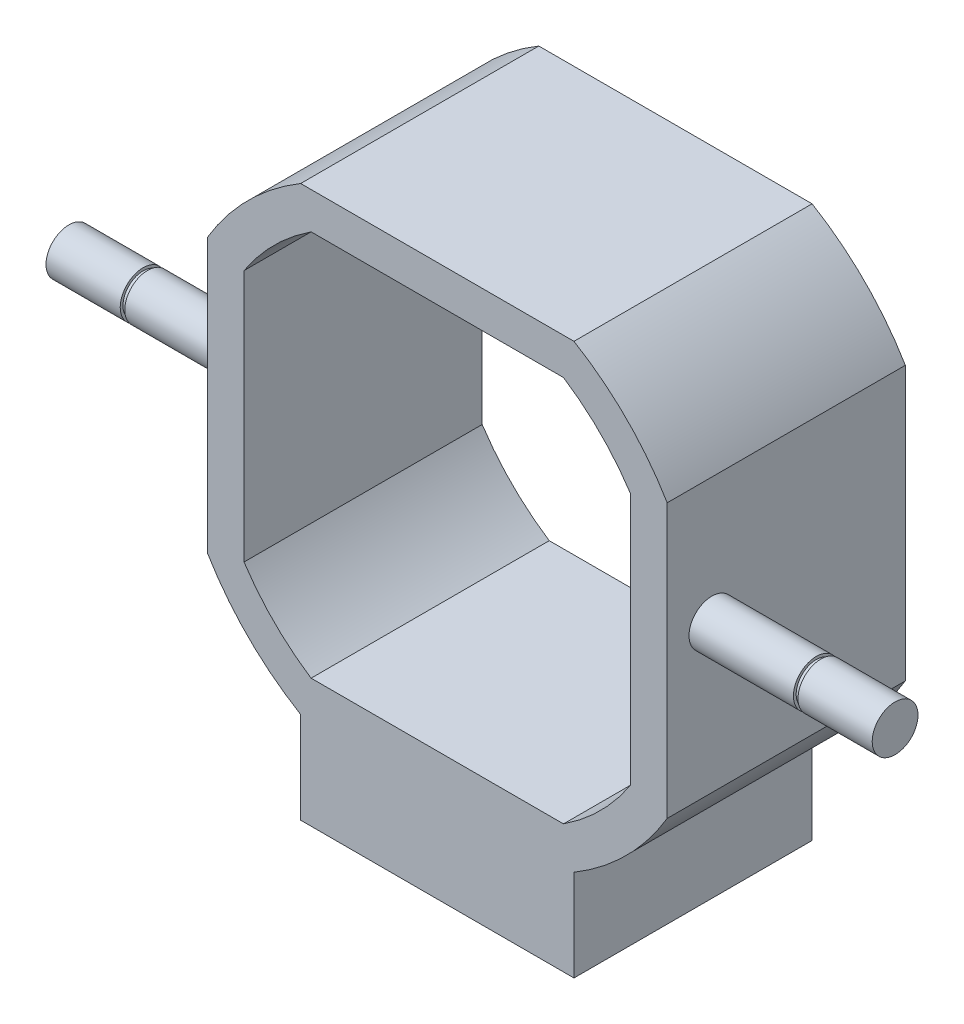
ISO-10303-21;
HEADER;
FILE_DESCRIPTION(('STEP AP214'),'2;1');
FILE_NAME('part.step','',(''),(''),'','','');
FILE_SCHEMA(('AUTOMOTIVE_DESIGN { 1 0 10303 214 1 1 1 1 }'));
ENDSEC;
DATA;
#1=APPLICATION_CONTEXT('core data for automotive mechanical design processes');
#2=APPLICATION_PROTOCOL_DEFINITION('international standard','automotive_design',2000,#1);
#3=PRODUCT_CONTEXT('',#1,'mechanical');
#4=PRODUCT('Part','Part','',(#3));
#5=PRODUCT_RELATED_PRODUCT_CATEGORY('part','',(#4));
#6=PRODUCT_DEFINITION_FORMATION('','',#4);
#7=PRODUCT_DEFINITION_CONTEXT('part definition',#1,'design');
#8=PRODUCT_DEFINITION('design','',#6,#7);
#9=PRODUCT_DEFINITION_SHAPE('','',#8);
#10=(LENGTH_UNIT() NAMED_UNIT(*) SI_UNIT(.MILLI.,.METRE.));
#11=(NAMED_UNIT(*) PLANE_ANGLE_UNIT() SI_UNIT($,.RADIAN.));
#12=(NAMED_UNIT(*) SI_UNIT($,.STERADIAN.) SOLID_ANGLE_UNIT());
#13=UNCERTAINTY_MEASURE_WITH_UNIT(LENGTH_MEASURE(1.E-05),#10,'distance_accuracy_value','');
#14=(GEOMETRIC_REPRESENTATION_CONTEXT(3) GLOBAL_UNCERTAINTY_ASSIGNED_CONTEXT((#13)) GLOBAL_UNIT_ASSIGNED_CONTEXT((#10,
#11,#12)) REPRESENTATION_CONTEXT('',''));
#15=CARTESIAN_POINT('',(0.,0.,0.));
#16=DIRECTION('',(0.,0.,1.));
#17=DIRECTION('',(1.,0.,0.));
#18=AXIS2_PLACEMENT_3D('',#15,#16,#17);
#19=CARTESIAN_POINT('',(-45.1,1.15999999999999,21.12));
#20=DIRECTION('',(1.,0.,0.));
#21=DIRECTION('',(0.,0.,-1.));
#22=AXIS2_PLACEMENT_3D('',#19,#20,#21);
#23=CYLINDRICAL_SURFACE('',#22,2.5);
#24=CARTESIAN_POINT('',(-25.1,1.15999999999999,21.12));
#25=DIRECTION('',(1.,0.,0.));
#26=DIRECTION('',(0.,0.,-1.));
#27=AXIS2_PLACEMENT_3D('',#24,#25,#26);
#28=CIRCLE('',#27,2.5);
#29=CARTESIAN_POINT('',(-25.1,1.15999999999999,18.62));
#30=VERTEX_POINT('',#29);
#31=EDGE_CURVE('E12',#30,#30,#28,.F.);
#32=ORIENTED_EDGE('',*,*,#31,.T.);
#33=EDGE_LOOP('',(#32));
#34=FACE_BOUND('',#33,.T.);
#35=CARTESIAN_POINT('',(-36.5,1.15999999999999,21.12));
#36=DIRECTION('',(-1.,0.,0.));
#37=DIRECTION('',(0.,0.,1.));
#38=AXIS2_PLACEMENT_3D('',#35,#36,#37);
#39=CIRCLE('',#38,2.5);
#40=CARTESIAN_POINT('',(-36.5,1.15999999999999,23.62));
#41=VERTEX_POINT('',#40);
#42=EDGE_CURVE('E384',#41,#41,#39,.T.);
#43=ORIENTED_EDGE('',*,*,#42,.F.);
#44=EDGE_LOOP('',(#43));
#45=FACE_BOUND('',#44,.T.);
#46=ADVANCED_FACE('F83',(#34,#45),#23,.T.);
#47=CARTESIAN_POINT('',(45.1,1.15999999999999,21.12));
#48=DIRECTION('',(-1.,0.,0.));
#49=DIRECTION('',(0.,0.,1.));
#50=AXIS2_PLACEMENT_3D('',#47,#48,#49);
#51=CYLINDRICAL_SURFACE('',#50,2.5);
#52=CARTESIAN_POINT('',(25.1,1.15999999999999,21.12));
#53=DIRECTION('',(-1.,0.,0.));
#54=DIRECTION('',(0.,-1.,0.));
#55=AXIS2_PLACEMENT_3D('',#52,#53,#54);
#56=CIRCLE('',#55,2.5);
#57=CARTESIAN_POINT('',(25.1,-1.34000000000001,21.12));
#58=VERTEX_POINT('',#57);
#59=EDGE_CURVE('E238',#58,#58,#56,.T.);
#60=ORIENTED_EDGE('',*,*,#59,.F.);
#61=EDGE_LOOP('',(#60));
#62=FACE_BOUND('',#61,.T.);
#63=CARTESIAN_POINT('',(36.5,1.16,21.12));
#64=DIRECTION('',(1.,0.,0.));
#65=DIRECTION('',(0.,1.,0.));
#66=AXIS2_PLACEMENT_3D('',#63,#64,#65);
#67=CIRCLE('',#66,2.5);
#68=CARTESIAN_POINT('',(36.5,3.65999999999999,21.12));
#69=VERTEX_POINT('',#68);
#70=EDGE_CURVE('E372',#69,#69,#67,.T.);
#71=ORIENTED_EDGE('',*,*,#70,.F.);
#72=EDGE_LOOP('',(#71));
#73=FACE_BOUND('',#72,.T.);
#74=ADVANCED_FACE('F417',(#62,#73),#51,.T.);
#75=CARTESIAN_POINT('',(0.,0.,26.));
#76=DIRECTION('',(0.,0.,1.));
#77=DIRECTION('',(1.,0.,0.));
#78=AXIS2_PLACEMENT_3D('',#75,#76,#77);
#79=PLANE('',#78);
#80=CARTESIAN_POINT('',(0.,0.,26.));
#81=DIRECTION('',(0.,0.,1.));
#82=DIRECTION('',(1.,0.,0.));
#83=AXIS2_PLACEMENT_3D('',#80,#81,#82);
#84=CIRCLE('',#83,29.2);
#85=CARTESIAN_POINT('',(14.9207908637579,-25.1,26.));
#86=VERTEX_POINT('',#85);
#87=CARTESIAN_POINT('',(25.1,-14.9207908637579,26.));
#88=VERTEX_POINT('',#87);
#89=EDGE_CURVE('E306',#86,#88,#84,.T.);
#90=ORIENTED_EDGE('',*,*,#89,.T.);
#91=DIRECTION('',(0.,1.,0.));
#92=VECTOR('',#91,1.);
#93=CARTESIAN_POINT('',(25.1,13.7778808239874,26.));
#94=LINE('',#93,#92);
#95=CARTESIAN_POINT('',(25.1,14.9207908637579,26.));
#96=VERTEX_POINT('',#95);
#97=EDGE_CURVE('E308',#88,#96,#94,.T.);
#98=ORIENTED_EDGE('',*,*,#97,.T.);
#99=CARTESIAN_POINT('',(0.,0.,26.));
#100=DIRECTION('',(0.,0.,1.));
#101=DIRECTION('',(1.,0.,0.));
#102=AXIS2_PLACEMENT_3D('',#99,#100,#101);
#103=CIRCLE('',#102,29.2);
#104=CARTESIAN_POINT('',(14.9207908637579,25.1,26.));
#105=VERTEX_POINT('',#104);
#106=EDGE_CURVE('E311',#96,#105,#103,.T.);
#107=ORIENTED_EDGE('',*,*,#106,.T.);
#108=DIRECTION('',(-1.,0.,0.));
#109=VECTOR('',#108,1.);
#110=CARTESIAN_POINT('',(-13.7778808239874,25.1,26.));
#111=LINE('',#110,#109);
#112=CARTESIAN_POINT('',(-14.9207908637579,25.1,26.));
#113=VERTEX_POINT('',#112);
#114=EDGE_CURVE('E313',#105,#113,#111,.T.);
#115=ORIENTED_EDGE('',*,*,#114,.T.);
#116=CARTESIAN_POINT('',(0.,0.,26.));
#117=DIRECTION('',(0.,0.,1.));
#118=DIRECTION('',(1.,0.,0.));
#119=AXIS2_PLACEMENT_3D('',#116,#117,#118);
#120=CIRCLE('',#119,29.2);
#121=CARTESIAN_POINT('',(-25.1,14.9207908637579,26.));
#122=VERTEX_POINT('',#121);
#123=EDGE_CURVE('E315',#113,#122,#120,.T.);
#124=ORIENTED_EDGE('',*,*,#123,.T.);
#125=DIRECTION('',(0.,-1.,0.));
#126=VECTOR('',#125,1.);
#127=CARTESIAN_POINT('',(-25.1,13.7778808239874,26.));
#128=LINE('',#127,#126);
#129=CARTESIAN_POINT('',(-25.1,-14.9207908637579,26.));
#130=VERTEX_POINT('',#129);
#131=EDGE_CURVE('E317',#122,#130,#128,.T.);
#132=ORIENTED_EDGE('',*,*,#131,.T.);
#133=CARTESIAN_POINT('',(0.,0.,26.));
#134=DIRECTION('',(0.,0.,1.));
#135=DIRECTION('',(1.,0.,0.));
#136=AXIS2_PLACEMENT_3D('',#133,#134,#135);
#137=CIRCLE('',#136,29.2);
#138=CARTESIAN_POINT('',(-14.9207908637579,-25.1,26.));
#139=VERTEX_POINT('',#138);
#140=EDGE_CURVE('E236',#130,#139,#137,.T.);
#141=ORIENTED_EDGE('',*,*,#140,.T.);
#142=DIRECTION('',(0.,1.,0.));
#143=VECTOR('',#142,1.);
#144=CARTESIAN_POINT('',(-14.9207908637579,-35.1,26.));
#145=LINE('',#144,#143);
#146=CARTESIAN_POINT('',(-14.9207908637579,-35.1,26.));
#147=VERTEX_POINT('',#146);
#148=EDGE_CURVE('E215',#147,#139,#145,.T.);
#149=ORIENTED_EDGE('',*,*,#148,.F.);
#150=DIRECTION('',(-1.,0.,0.));
#151=VECTOR('',#150,1.);
#152=CARTESIAN_POINT('',(-14.9207908637579,-35.1,26.));
#153=LINE('',#152,#151);
#154=CARTESIAN_POINT('',(14.9207908637579,-35.1,26.));
#155=VERTEX_POINT('',#154);
#156=EDGE_CURVE('E221',#155,#147,#153,.T.);
#157=ORIENTED_EDGE('',*,*,#156,.F.);
#158=DIRECTION('',(0.,1.,0.));
#159=VECTOR('',#158,1.);
#160=CARTESIAN_POINT('',(14.9207908637579,-35.1,26.));
#161=LINE('',#160,#159);
#162=EDGE_CURVE('E367',#155,#86,#161,.T.);
#163=ORIENTED_EDGE('',*,*,#162,.T.);
#164=EDGE_LOOP('',(#90,#98,#107,#115,#124,#132,#141,#149,#157,#163));
#165=FACE_BOUND('',#164,.T.);
#166=DIRECTION('',(0.,1.,0.));
#167=VECTOR('',#166,1.);
#168=CARTESIAN_POINT('',(21.1,13.7778808239874,26.));
#169=LINE('',#168,#167);
#170=CARTESIAN_POINT('',(21.1,-13.7778808239874,26.));
#171=VERTEX_POINT('',#170);
#172=CARTESIAN_POINT('',(21.1,13.7778808239874,26.));
#173=VERTEX_POINT('',#172);
#174=EDGE_CURVE('E254',#171,#173,#169,.T.);
#175=ORIENTED_EDGE('',*,*,#174,.F.);
#176=CARTESIAN_POINT('',(0.,0.,26.));
#177=DIRECTION('',(0.,0.,1.));
#178=DIRECTION('',(1.,0.,0.));
#179=AXIS2_PLACEMENT_3D('',#176,#177,#178);
#180=CIRCLE('',#179,25.2);
#181=CARTESIAN_POINT('',(13.7778808239874,-21.1,26.));
#182=VERTEX_POINT('',#181);
#183=EDGE_CURVE('E252',#182,#171,#180,.T.);
#184=ORIENTED_EDGE('',*,*,#183,.F.);
#185=DIRECTION('',(1.,0.,0.));
#186=VECTOR('',#185,1.);
#187=CARTESIAN_POINT('',(-13.7778808239874,-21.1,26.));
#188=LINE('',#187,#186);
#189=CARTESIAN_POINT('',(-13.7778808239874,-21.1,26.));
#190=VERTEX_POINT('',#189);
#191=EDGE_CURVE('E267',#190,#182,#188,.T.);
#192=ORIENTED_EDGE('',*,*,#191,.F.);
#193=CARTESIAN_POINT('',(0.,0.,26.));
#194=DIRECTION('',(0.,0.,1.));
#195=DIRECTION('',(1.,0.,0.));
#196=AXIS2_PLACEMENT_3D('',#193,#194,#195);
#197=CIRCLE('',#196,25.2);
#198=CARTESIAN_POINT('',(-21.1,-13.7778808239874,26.));
#199=VERTEX_POINT('',#198);
#200=EDGE_CURVE('E265',#199,#190,#197,.T.);
#201=ORIENTED_EDGE('',*,*,#200,.F.);
#202=DIRECTION('',(0.,-1.,0.));
#203=VECTOR('',#202,1.);
#204=CARTESIAN_POINT('',(-21.1,13.7778808239874,26.));
#205=LINE('',#204,#203);
#206=CARTESIAN_POINT('',(-21.1,13.7778808239874,26.));
#207=VERTEX_POINT('',#206);
#208=EDGE_CURVE('E263',#207,#199,#205,.T.);
#209=ORIENTED_EDGE('',*,*,#208,.F.);
#210=CARTESIAN_POINT('',(0.,0.,26.));
#211=DIRECTION('',(0.,0.,1.));
#212=DIRECTION('',(1.,0.,0.));
#213=AXIS2_PLACEMENT_3D('',#210,#211,#212);
#214=CIRCLE('',#213,25.2);
#215=CARTESIAN_POINT('',(-13.7778808239874,21.1,26.));
#216=VERTEX_POINT('',#215);
#217=EDGE_CURVE('E261',#216,#207,#214,.T.);
#218=ORIENTED_EDGE('',*,*,#217,.F.);
#219=DIRECTION('',(-1.,0.,0.));
#220=VECTOR('',#219,1.);
#221=CARTESIAN_POINT('',(-13.7778808239874,21.1,26.));
#222=LINE('',#221,#220);
#223=CARTESIAN_POINT('',(13.7778808239874,21.1,26.));
#224=VERTEX_POINT('',#223);
#225=EDGE_CURVE('E259',#224,#216,#222,.T.);
#226=ORIENTED_EDGE('',*,*,#225,.F.);
#227=CARTESIAN_POINT('',(0.,0.,26.));
#228=DIRECTION('',(0.,0.,1.));
#229=DIRECTION('',(1.,0.,0.));
#230=AXIS2_PLACEMENT_3D('',#227,#228,#229);
#231=CIRCLE('',#230,25.2);
#232=EDGE_CURVE('E257',#173,#224,#231,.T.);
#233=ORIENTED_EDGE('',*,*,#232,.F.);
#234=EDGE_LOOP('',(#175,#184,#192,#201,#209,#218,#226,#233));
#235=FACE_BOUND('',#234,.T.);
#236=ADVANCED_FACE('F233',(#165,#235),#79,.T.);
#237=CARTESIAN_POINT('',(0.,0.,0.));
#238=DIRECTION('',(0.,0.,1.));
#239=DIRECTION('',(1.,0.,0.));
#240=AXIS2_PLACEMENT_3D('',#237,#238,#239);
#241=PLANE('',#240);
#242=CARTESIAN_POINT('',(0.,0.,0.));
#243=DIRECTION('',(0.,0.,1.));
#244=DIRECTION('',(1.,0.,0.));
#245=AXIS2_PLACEMENT_3D('',#242,#243,#244);
#246=CIRCLE('',#245,29.2);
#247=CARTESIAN_POINT('',(14.9207908637579,-25.1,0.));
#248=VERTEX_POINT('',#247);
#249=CARTESIAN_POINT('',(25.1,-14.9207908637579,0.));
#250=VERTEX_POINT('',#249);
#251=EDGE_CURVE('E305',#248,#250,#246,.T.);
#252=ORIENTED_EDGE('',*,*,#251,.F.);
#253=DIRECTION('',(0.,1.,0.));
#254=VECTOR('',#253,1.);
#255=CARTESIAN_POINT('',(14.9207908637579,-35.1,0.));
#256=LINE('',#255,#254);
#257=CARTESIAN_POINT('',(14.9207908637579,-35.1,0.));
#258=VERTEX_POINT('',#257);
#259=EDGE_CURVE('E243',#258,#248,#256,.T.);
#260=ORIENTED_EDGE('',*,*,#259,.F.);
#261=DIRECTION('',(1.,0.,0.));
#262=VECTOR('',#261,1.);
#263=CARTESIAN_POINT('',(-14.9207908637579,-35.1,0.));
#264=LINE('',#263,#262);
#265=CARTESIAN_POINT('',(-14.9207908637579,-35.1,0.));
#266=VERTEX_POINT('',#265);
#267=EDGE_CURVE('E220',#266,#258,#264,.T.);
#268=ORIENTED_EDGE('',*,*,#267,.F.);
#269=DIRECTION('',(0.,1.,0.));
#270=VECTOR('',#269,1.);
#271=CARTESIAN_POINT('',(-14.9207908637579,-35.1,0.));
#272=LINE('',#271,#270);
#273=CARTESIAN_POINT('',(-14.9207908637579,-25.1,0.));
#274=VERTEX_POINT('',#273);
#275=EDGE_CURVE('E217',#266,#274,#272,.T.);
#276=ORIENTED_EDGE('',*,*,#275,.T.);
#277=CARTESIAN_POINT('',(0.,0.,0.));
#278=DIRECTION('',(0.,0.,1.));
#279=DIRECTION('',(1.,0.,0.));
#280=AXIS2_PLACEMENT_3D('',#277,#278,#279);
#281=CIRCLE('',#280,29.2);
#282=CARTESIAN_POINT('',(-25.1,-14.9207908637579,0.));
#283=VERTEX_POINT('',#282);
#284=EDGE_CURVE('E309',#283,#274,#281,.T.);
#285=ORIENTED_EDGE('',*,*,#284,.F.);
#286=DIRECTION('',(0.,-1.,0.));
#287=VECTOR('',#286,1.);
#288=CARTESIAN_POINT('',(-25.1,13.7778808239874,0.));
#289=LINE('',#288,#287);
#290=CARTESIAN_POINT('',(-25.1,14.9207908637579,0.));
#291=VERTEX_POINT('',#290);
#292=EDGE_CURVE('E331',#291,#283,#289,.T.);
#293=ORIENTED_EDGE('',*,*,#292,.F.);
#294=CARTESIAN_POINT('',(0.,0.,0.));
#295=DIRECTION('',(0.,0.,1.));
#296=DIRECTION('',(1.,0.,0.));
#297=AXIS2_PLACEMENT_3D('',#294,#295,#296);
#298=CIRCLE('',#297,29.2);
#299=CARTESIAN_POINT('',(-14.9207908637579,25.1,0.));
#300=VERTEX_POINT('',#299);
#301=EDGE_CURVE('E329',#300,#291,#298,.T.);
#302=ORIENTED_EDGE('',*,*,#301,.F.);
#303=DIRECTION('',(-1.,0.,0.));
#304=VECTOR('',#303,1.);
#305=CARTESIAN_POINT('',(-13.7778808239874,25.1,0.));
#306=LINE('',#305,#304);
#307=CARTESIAN_POINT('',(14.9207908637579,25.1,0.));
#308=VERTEX_POINT('',#307);
#309=EDGE_CURVE('E327',#308,#300,#306,.T.);
#310=ORIENTED_EDGE('',*,*,#309,.F.);
#311=CARTESIAN_POINT('',(0.,0.,0.));
#312=DIRECTION('',(0.,0.,1.));
#313=DIRECTION('',(1.,0.,0.));
#314=AXIS2_PLACEMENT_3D('',#311,#312,#313);
#315=CIRCLE('',#314,29.2);
#316=CARTESIAN_POINT('',(25.1,14.9207908637579,0.));
#317=VERTEX_POINT('',#316);
#318=EDGE_CURVE('E325',#317,#308,#315,.T.);
#319=ORIENTED_EDGE('',*,*,#318,.F.);
#320=DIRECTION('',(0.,1.,0.));
#321=VECTOR('',#320,1.);
#322=CARTESIAN_POINT('',(25.1,13.7778808239874,0.));
#323=LINE('',#322,#321);
#324=EDGE_CURVE('E323',#250,#317,#323,.T.);
#325=ORIENTED_EDGE('',*,*,#324,.F.);
#326=EDGE_LOOP('',(#252,#260,#268,#276,#285,#293,#302,#310,#319,#325));
#327=FACE_BOUND('',#326,.T.);
#328=CARTESIAN_POINT('',(0.,0.,0.));
#329=DIRECTION('',(0.,0.,1.));
#330=DIRECTION('',(1.,0.,0.));
#331=AXIS2_PLACEMENT_3D('',#328,#329,#330);
#332=CIRCLE('',#331,25.2);
#333=CARTESIAN_POINT('',(13.7778808239874,-21.1,0.));
#334=VERTEX_POINT('',#333);
#335=CARTESIAN_POINT('',(21.1,-13.7778808239874,0.));
#336=VERTEX_POINT('',#335);
#337=EDGE_CURVE('E106',#334,#336,#332,.T.);
#338=ORIENTED_EDGE('',*,*,#337,.T.);
#339=DIRECTION('',(0.,1.,0.));
#340=VECTOR('',#339,1.);
#341=CARTESIAN_POINT('',(21.1,13.7778808239874,0.));
#342=LINE('',#341,#340);
#343=CARTESIAN_POINT('',(21.1,13.7778808239874,0.));
#344=VERTEX_POINT('',#343);
#345=EDGE_CURVE('E271',#336,#344,#342,.T.);
#346=ORIENTED_EDGE('',*,*,#345,.T.);
#347=CARTESIAN_POINT('',(0.,0.,0.));
#348=DIRECTION('',(0.,0.,1.));
#349=DIRECTION('',(1.,0.,0.));
#350=AXIS2_PLACEMENT_3D('',#347,#348,#349);
#351=CIRCLE('',#350,25.2);
#352=CARTESIAN_POINT('',(13.7778808239874,21.1,0.));
#353=VERTEX_POINT('',#352);
#354=EDGE_CURVE('E274',#344,#353,#351,.T.);
#355=ORIENTED_EDGE('',*,*,#354,.T.);
#356=DIRECTION('',(-1.,0.,0.));
#357=VECTOR('',#356,1.);
#358=CARTESIAN_POINT('',(-13.7778808239874,21.1,0.));
#359=LINE('',#358,#357);
#360=CARTESIAN_POINT('',(-13.7778808239874,21.1,0.));
#361=VERTEX_POINT('',#360);
#362=EDGE_CURVE('E277',#353,#361,#359,.T.);
#363=ORIENTED_EDGE('',*,*,#362,.T.);
#364=CARTESIAN_POINT('',(0.,0.,0.));
#365=DIRECTION('',(0.,0.,1.));
#366=DIRECTION('',(1.,0.,0.));
#367=AXIS2_PLACEMENT_3D('',#364,#365,#366);
#368=CIRCLE('',#367,25.2);
#369=CARTESIAN_POINT('',(-21.1,13.7778808239874,0.));
#370=VERTEX_POINT('',#369);
#371=EDGE_CURVE('E280',#361,#370,#368,.T.);
#372=ORIENTED_EDGE('',*,*,#371,.T.);
#373=DIRECTION('',(0.,-1.,0.));
#374=VECTOR('',#373,1.);
#375=CARTESIAN_POINT('',(-21.1,13.7778808239874,0.));
#376=LINE('',#375,#374);
#377=CARTESIAN_POINT('',(-21.1,-13.7778808239874,0.));
#378=VERTEX_POINT('',#377);
#379=EDGE_CURVE('E283',#370,#378,#376,.T.);
#380=ORIENTED_EDGE('',*,*,#379,.T.);
#381=CARTESIAN_POINT('',(0.,0.,0.));
#382=DIRECTION('',(0.,0.,1.));
#383=DIRECTION('',(1.,0.,0.));
#384=AXIS2_PLACEMENT_3D('',#381,#382,#383);
#385=CIRCLE('',#384,25.2);
#386=CARTESIAN_POINT('',(-13.7778808239874,-21.1,0.));
#387=VERTEX_POINT('',#386);
#388=EDGE_CURVE('E286',#378,#387,#385,.T.);
#389=ORIENTED_EDGE('',*,*,#388,.T.);
#390=DIRECTION('',(1.,0.,0.));
#391=VECTOR('',#390,1.);
#392=CARTESIAN_POINT('',(-13.7778808239874,-21.1,0.));
#393=LINE('',#392,#391);
#394=EDGE_CURVE('E255',#387,#334,#393,.T.);
#395=ORIENTED_EDGE('',*,*,#394,.T.);
#396=EDGE_LOOP('',(#338,#346,#355,#363,#372,#380,#389,#395));
#397=FACE_BOUND('',#396,.T.);
#398=ADVANCED_FACE('F362',(#327,#397),#241,.F.);
#399=CARTESIAN_POINT('',(0.,0.,26.));
#400=DIRECTION('',(0.,0.,-1.));
#401=DIRECTION('',(-1.,0.,0.));
#402=AXIS2_PLACEMENT_3D('',#399,#400,#401);
#403=CYLINDRICAL_SURFACE('',#402,29.2);
#404=ORIENTED_EDGE('',*,*,#251,.T.);
#405=DIRECTION('',(0.,0.,-1.));
#406=VECTOR('',#405,1.);
#407=CARTESIAN_POINT('',(25.1,-14.9207908637579,26.));
#408=LINE('',#407,#406);
#409=EDGE_CURVE('E91',#88,#250,#408,.T.);
#410=ORIENTED_EDGE('',*,*,#409,.F.);
#411=ORIENTED_EDGE('',*,*,#89,.F.);
#412=DIRECTION('',(0.,0.,-1.));
#413=VECTOR('',#412,1.);
#414=CARTESIAN_POINT('',(14.9207908637579,-25.1,26.));
#415=LINE('',#414,#413);
#416=EDGE_CURVE('E320',#86,#248,#415,.T.);
#417=ORIENTED_EDGE('',*,*,#416,.T.);
#418=EDGE_LOOP('',(#404,#410,#411,#417));
#419=FACE_BOUND('',#418,.T.);
#420=ADVANCED_FACE('F85',(#419),#403,.T.);
#421=CARTESIAN_POINT('',(25.1,13.7778808239874,26.));
#422=DIRECTION('',(-1.,0.,0.));
#423=DIRECTION('',(0.,-1.,0.));
#424=AXIS2_PLACEMENT_3D('',#421,#422,#423);
#425=PLANE('',#424);
#426=ORIENTED_EDGE('',*,*,#59,.T.);
#427=EDGE_LOOP('',(#426));
#428=FACE_BOUND('',#427,.T.);
#429=ORIENTED_EDGE('',*,*,#324,.T.);
#430=DIRECTION('',(0.,0.,-1.));
#431=VECTOR('',#430,1.);
#432=CARTESIAN_POINT('',(25.1,14.9207908637579,26.));
#433=LINE('',#432,#431);
#434=EDGE_CURVE('E349',#96,#317,#433,.T.);
#435=ORIENTED_EDGE('',*,*,#434,.F.);
#436=ORIENTED_EDGE('',*,*,#97,.F.);
#437=ORIENTED_EDGE('',*,*,#409,.T.);
#438=EDGE_LOOP('',(#429,#435,#436,#437));
#439=FACE_BOUND('',#438,.T.);
#440=ADVANCED_FACE('F354',(#428,#439),#425,.F.);
#441=CARTESIAN_POINT('',(0.,0.,26.));
#442=DIRECTION('',(0.,0.,-1.));
#443=DIRECTION('',(-1.,0.,0.));
#444=AXIS2_PLACEMENT_3D('',#441,#442,#443);
#445=CYLINDRICAL_SURFACE('',#444,29.2);
#446=ORIENTED_EDGE('',*,*,#318,.T.);
#447=DIRECTION('',(0.,0.,-1.));
#448=VECTOR('',#447,1.);
#449=CARTESIAN_POINT('',(14.9207908637579,25.1,26.));
#450=LINE('',#449,#448);
#451=EDGE_CURVE('E346',#105,#308,#450,.T.);
#452=ORIENTED_EDGE('',*,*,#451,.F.);
#453=ORIENTED_EDGE('',*,*,#106,.F.);
#454=ORIENTED_EDGE('',*,*,#434,.T.);
#455=EDGE_LOOP('',(#446,#452,#453,#454));
#456=FACE_BOUND('',#455,.T.);
#457=ADVANCED_FACE('F670',(#456),#445,.T.);
#458=CARTESIAN_POINT('',(-13.7778808239874,25.1,26.));
#459=DIRECTION('',(0.,-1.,0.));
#460=DIRECTION('',(0.,0.,-1.));
#461=AXIS2_PLACEMENT_3D('',#458,#459,#460);
#462=PLANE('',#461);
#463=ORIENTED_EDGE('',*,*,#309,.T.);
#464=DIRECTION('',(0.,0.,-1.));
#465=VECTOR('',#464,1.);
#466=CARTESIAN_POINT('',(-14.9207908637579,25.1,26.));
#467=LINE('',#466,#465);
#468=EDGE_CURVE('E343',#113,#300,#467,.T.);
#469=ORIENTED_EDGE('',*,*,#468,.F.);
#470=ORIENTED_EDGE('',*,*,#114,.F.);
#471=ORIENTED_EDGE('',*,*,#451,.T.);
#472=EDGE_LOOP('',(#463,#469,#470,#471));
#473=FACE_BOUND('',#472,.T.);
#474=ADVANCED_FACE('F661',(#473),#462,.F.);
#475=CARTESIAN_POINT('',(0.,0.,26.));
#476=DIRECTION('',(0.,0.,-1.));
#477=DIRECTION('',(-1.,0.,0.));
#478=AXIS2_PLACEMENT_3D('',#475,#476,#477);
#479=CYLINDRICAL_SURFACE('',#478,29.2);
#480=ORIENTED_EDGE('',*,*,#301,.T.);
#481=DIRECTION('',(0.,0.,-1.));
#482=VECTOR('',#481,1.);
#483=CARTESIAN_POINT('',(-25.1,14.9207908637579,26.));
#484=LINE('',#483,#482);
#485=EDGE_CURVE('E340',#122,#291,#484,.T.);
#486=ORIENTED_EDGE('',*,*,#485,.F.);
#487=ORIENTED_EDGE('',*,*,#123,.F.);
#488=ORIENTED_EDGE('',*,*,#468,.T.);
#489=EDGE_LOOP('',(#480,#486,#487,#488));
#490=FACE_BOUND('',#489,.T.);
#491=ADVANCED_FACE('F653',(#490),#479,.T.);
#492=CARTESIAN_POINT('',(-25.1,13.7778808239874,26.));
#493=DIRECTION('',(1.,0.,0.));
#494=DIRECTION('',(0.,0.,-1.));
#495=AXIS2_PLACEMENT_3D('',#492,#493,#494);
#496=PLANE('',#495);
#497=ORIENTED_EDGE('',*,*,#31,.F.);
#498=EDGE_LOOP('',(#497));
#499=FACE_BOUND('',#498,.T.);
#500=ORIENTED_EDGE('',*,*,#292,.T.);
#501=DIRECTION('',(0.,0.,-1.));
#502=VECTOR('',#501,1.);
#503=CARTESIAN_POINT('',(-25.1,-14.9207908637579,26.));
#504=LINE('',#503,#502);
#505=EDGE_CURVE('E337',#130,#283,#504,.T.);
#506=ORIENTED_EDGE('',*,*,#505,.F.);
#507=ORIENTED_EDGE('',*,*,#131,.F.);
#508=ORIENTED_EDGE('',*,*,#485,.T.);
#509=EDGE_LOOP('',(#500,#506,#507,#508));
#510=FACE_BOUND('',#509,.T.);
#511=ADVANCED_FACE('F645',(#499,#510),#496,.F.);
#512=CARTESIAN_POINT('',(0.,0.,26.));
#513=DIRECTION('',(0.,0.,-1.));
#514=DIRECTION('',(-1.,0.,0.));
#515=AXIS2_PLACEMENT_3D('',#512,#513,#514);
#516=CYLINDRICAL_SURFACE('',#515,29.2);
#517=ORIENTED_EDGE('',*,*,#284,.T.);
#518=DIRECTION('',(0.,0.,-1.));
#519=VECTOR('',#518,1.);
#520=CARTESIAN_POINT('',(-14.9207908637579,-25.1,26.));
#521=LINE('',#520,#519);
#522=EDGE_CURVE('E335',#139,#274,#521,.T.);
#523=ORIENTED_EDGE('',*,*,#522,.F.);
#524=ORIENTED_EDGE('',*,*,#140,.F.);
#525=ORIENTED_EDGE('',*,*,#505,.T.);
#526=EDGE_LOOP('',(#517,#523,#524,#525));
#527=FACE_BOUND('',#526,.T.);
#528=ADVANCED_FACE('F637',(#527),#516,.T.);
#529=CARTESIAN_POINT('',(0.,0.,26.));
#530=DIRECTION('',(0.,0.,-1.));
#531=DIRECTION('',(-1.,0.,0.));
#532=AXIS2_PLACEMENT_3D('',#529,#530,#531);
#533=CYLINDRICAL_SURFACE('',#532,25.2);
#534=ORIENTED_EDGE('',*,*,#337,.F.);
#535=DIRECTION('',(0.,0.,-1.));
#536=VECTOR('',#535,1.);
#537=CARTESIAN_POINT('',(13.7778808239874,-21.1,26.));
#538=LINE('',#537,#536);
#539=EDGE_CURVE('E269',#182,#334,#538,.T.);
#540=ORIENTED_EDGE('',*,*,#539,.F.);
#541=ORIENTED_EDGE('',*,*,#183,.T.);
#542=DIRECTION('',(0.,0.,-1.));
#543=VECTOR('',#542,1.);
#544=CARTESIAN_POINT('',(21.1,-13.7778808239874,26.));
#545=LINE('',#544,#543);
#546=EDGE_CURVE('E303',#171,#336,#545,.T.);
#547=ORIENTED_EDGE('',*,*,#546,.T.);
#548=EDGE_LOOP('',(#534,#540,#541,#547));
#549=FACE_BOUND('',#548,.T.);
#550=ADVANCED_FACE('F628',(#549),#533,.F.);
#551=CARTESIAN_POINT('',(21.1,13.7778808239874,26.));
#552=DIRECTION('',(-1.,0.,0.));
#553=DIRECTION('',(0.,-1.,0.));
#554=AXIS2_PLACEMENT_3D('',#551,#552,#553);
#555=PLANE('',#554);
#556=ORIENTED_EDGE('',*,*,#345,.F.);
#557=ORIENTED_EDGE('',*,*,#546,.F.);
#558=ORIENTED_EDGE('',*,*,#174,.T.);
#559=DIRECTION('',(0.,0.,-1.));
#560=VECTOR('',#559,1.);
#561=CARTESIAN_POINT('',(21.1,13.7778808239874,26.));
#562=LINE('',#561,#560);
#563=EDGE_CURVE('E301',#173,#344,#562,.T.);
#564=ORIENTED_EDGE('',*,*,#563,.T.);
#565=EDGE_LOOP('',(#556,#557,#558,#564));
#566=FACE_BOUND('',#565,.T.);
#567=ADVANCED_FACE('F619',(#566),#555,.T.);
#568=CARTESIAN_POINT('',(0.,0.,26.));
#569=DIRECTION('',(0.,0.,-1.));
#570=DIRECTION('',(-1.,0.,0.));
#571=AXIS2_PLACEMENT_3D('',#568,#569,#570);
#572=CYLINDRICAL_SURFACE('',#571,25.2);
#573=ORIENTED_EDGE('',*,*,#354,.F.);
#574=ORIENTED_EDGE('',*,*,#563,.F.);
#575=ORIENTED_EDGE('',*,*,#232,.T.);
#576=DIRECTION('',(0.,0.,-1.));
#577=VECTOR('',#576,1.);
#578=CARTESIAN_POINT('',(13.7778808239874,21.1,26.));
#579=LINE('',#578,#577);
#580=EDGE_CURVE('E299',#224,#353,#579,.T.);
#581=ORIENTED_EDGE('',*,*,#580,.T.);
#582=EDGE_LOOP('',(#573,#574,#575,#581));
#583=FACE_BOUND('',#582,.T.);
#584=ADVANCED_FACE('F610',(#583),#572,.F.);
#585=CARTESIAN_POINT('',(-13.7778808239874,21.1,26.));
#586=DIRECTION('',(0.,-1.,0.));
#587=DIRECTION('',(0.,0.,-1.));
#588=AXIS2_PLACEMENT_3D('',#585,#586,#587);
#589=PLANE('',#588);
#590=ORIENTED_EDGE('',*,*,#362,.F.);
#591=ORIENTED_EDGE('',*,*,#580,.F.);
#592=ORIENTED_EDGE('',*,*,#225,.T.);
#593=DIRECTION('',(0.,0.,-1.));
#594=VECTOR('',#593,1.);
#595=CARTESIAN_POINT('',(-13.7778808239874,21.1,26.));
#596=LINE('',#595,#594);
#597=EDGE_CURVE('E297',#216,#361,#596,.T.);
#598=ORIENTED_EDGE('',*,*,#597,.T.);
#599=EDGE_LOOP('',(#590,#591,#592,#598));
#600=FACE_BOUND('',#599,.T.);
#601=ADVANCED_FACE('F601',(#600),#589,.T.);
#602=CARTESIAN_POINT('',(0.,0.,26.));
#603=DIRECTION('',(0.,0.,-1.));
#604=DIRECTION('',(-1.,0.,0.));
#605=AXIS2_PLACEMENT_3D('',#602,#603,#604);
#606=CYLINDRICAL_SURFACE('',#605,25.2);
#607=ORIENTED_EDGE('',*,*,#371,.F.);
#608=ORIENTED_EDGE('',*,*,#597,.F.);
#609=ORIENTED_EDGE('',*,*,#217,.T.);
#610=DIRECTION('',(0.,0.,-1.));
#611=VECTOR('',#610,1.);
#612=CARTESIAN_POINT('',(-21.1,13.7778808239874,26.));
#613=LINE('',#612,#611);
#614=EDGE_CURVE('E295',#207,#370,#613,.T.);
#615=ORIENTED_EDGE('',*,*,#614,.T.);
#616=EDGE_LOOP('',(#607,#608,#609,#615));
#617=FACE_BOUND('',#616,.T.);
#618=ADVANCED_FACE('F592',(#617),#606,.F.);
#619=CARTESIAN_POINT('',(-21.1,13.7778808239874,26.));
#620=DIRECTION('',(1.,0.,0.));
#621=DIRECTION('',(0.,0.,-1.));
#622=AXIS2_PLACEMENT_3D('',#619,#620,#621);
#623=PLANE('',#622);
#624=ORIENTED_EDGE('',*,*,#379,.F.);
#625=ORIENTED_EDGE('',*,*,#614,.F.);
#626=ORIENTED_EDGE('',*,*,#208,.T.);
#627=DIRECTION('',(0.,0.,-1.));
#628=VECTOR('',#627,1.);
#629=CARTESIAN_POINT('',(-21.1,-13.7778808239874,26.));
#630=LINE('',#629,#628);
#631=EDGE_CURVE('E293',#199,#378,#630,.T.);
#632=ORIENTED_EDGE('',*,*,#631,.T.);
#633=EDGE_LOOP('',(#624,#625,#626,#632));
#634=FACE_BOUND('',#633,.T.);
#635=ADVANCED_FACE('F583',(#634),#623,.T.);
#636=CARTESIAN_POINT('',(0.,0.,26.));
#637=DIRECTION('',(0.,0.,-1.));
#638=DIRECTION('',(-1.,0.,0.));
#639=AXIS2_PLACEMENT_3D('',#636,#637,#638);
#640=CYLINDRICAL_SURFACE('',#639,25.2);
#641=ORIENTED_EDGE('',*,*,#388,.F.);
#642=ORIENTED_EDGE('',*,*,#631,.F.);
#643=ORIENTED_EDGE('',*,*,#200,.T.);
#644=DIRECTION('',(0.,0.,-1.));
#645=VECTOR('',#644,1.);
#646=CARTESIAN_POINT('',(-13.7778808239874,-21.1,26.));
#647=LINE('',#646,#645);
#648=EDGE_CURVE('E98',#190,#387,#647,.T.);
#649=ORIENTED_EDGE('',*,*,#648,.T.);
#650=EDGE_LOOP('',(#641,#642,#643,#649));
#651=FACE_BOUND('',#650,.T.);
#652=ADVANCED_FACE('F576',(#651),#640,.F.);
#653=CARTESIAN_POINT('',(-13.7778808239874,-21.1,26.));
#654=DIRECTION('',(0.,1.,0.));
#655=DIRECTION('',(0.,0.,1.));
#656=AXIS2_PLACEMENT_3D('',#653,#654,#655);
#657=PLANE('',#656);
#658=ORIENTED_EDGE('',*,*,#394,.F.);
#659=ORIENTED_EDGE('',*,*,#648,.F.);
#660=ORIENTED_EDGE('',*,*,#191,.T.);
#661=ORIENTED_EDGE('',*,*,#539,.T.);
#662=EDGE_LOOP('',(#658,#659,#660,#661));
#663=FACE_BOUND('',#662,.T.);
#664=ADVANCED_FACE('F453',(#663),#657,.T.);
#665=CARTESIAN_POINT('',(-14.9207908637579,-35.1,26.));
#666=DIRECTION('',(1.,0.,0.));
#667=DIRECTION('',(0.,0.,-1.));
#668=AXIS2_PLACEMENT_3D('',#665,#666,#667);
#669=PLANE('',#668);
#670=ORIENTED_EDGE('',*,*,#522,.T.);
#671=ORIENTED_EDGE('',*,*,#275,.F.);
#672=DIRECTION('',(0.,0.,-1.));
#673=VECTOR('',#672,1.);
#674=CARTESIAN_POINT('',(-14.9207908637579,-35.1,26.));
#675=LINE('',#674,#673);
#676=EDGE_CURVE('E210',#147,#266,#675,.T.);
#677=ORIENTED_EDGE('',*,*,#676,.F.);
#678=ORIENTED_EDGE('',*,*,#148,.T.);
#679=EDGE_LOOP('',(#670,#671,#677,#678));
#680=FACE_BOUND('',#679,.T.);
#681=ADVANCED_FACE('F213',(#680),#669,.F.);
#682=CARTESIAN_POINT('',(14.9207908637579,-35.1,26.));
#683=DIRECTION('',(-1.,0.,0.));
#684=DIRECTION('',(0.,0.,1.));
#685=AXIS2_PLACEMENT_3D('',#682,#683,#684);
#686=PLANE('',#685);
#687=ORIENTED_EDGE('',*,*,#416,.F.);
#688=ORIENTED_EDGE('',*,*,#162,.F.);
#689=DIRECTION('',(0.,0.,1.));
#690=VECTOR('',#689,1.);
#691=CARTESIAN_POINT('',(14.9207908637579,-35.1,26.));
#692=LINE('',#691,#690);
#693=EDGE_CURVE('E226',#258,#155,#692,.T.);
#694=ORIENTED_EDGE('',*,*,#693,.F.);
#695=ORIENTED_EDGE('',*,*,#259,.T.);
#696=EDGE_LOOP('',(#687,#688,#694,#695));
#697=FACE_BOUND('',#696,.T.);
#698=ADVANCED_FACE('F366',(#697),#686,.F.);
#699=CARTESIAN_POINT('',(0.,-35.1,0.));
#700=DIRECTION('',(0.,1.,0.));
#701=DIRECTION('',(0.,0.,1.));
#702=AXIS2_PLACEMENT_3D('',#699,#700,#701);
#703=PLANE('',#702);
#704=ORIENTED_EDGE('',*,*,#156,.T.);
#705=ORIENTED_EDGE('',*,*,#676,.T.);
#706=ORIENTED_EDGE('',*,*,#267,.T.);
#707=ORIENTED_EDGE('',*,*,#693,.T.);
#708=EDGE_LOOP('',(#704,#705,#706,#707));
#709=FACE_BOUND('',#708,.T.);
#710=ADVANCED_FACE('F224',(#709),#703,.F.);
#711=CARTESIAN_POINT('',(37.,1.16,21.12));
#712=DIRECTION('',(1.,0.,0.));
#713=DIRECTION('',(0.,1.,0.));
#714=AXIS2_PLACEMENT_3D('',#711,#712,#713);
#715=PLANE('',#714);
#716=CARTESIAN_POINT('',(37.,1.16,21.12));
#717=DIRECTION('',(1.,0.,0.));
#718=DIRECTION('',(0.,1.,0.));
#719=AXIS2_PLACEMENT_3D('',#716,#717,#718);
#720=CIRCLE('',#719,2.5);
#721=CARTESIAN_POINT('',(37.,3.65999999999999,21.12));
#722=VERTEX_POINT('',#721);
#723=EDGE_CURVE('E230',#722,#722,#720,.T.);
#724=ORIENTED_EDGE('',*,*,#723,.F.);
#725=EDGE_LOOP('',(#724));
#726=FACE_BOUND('',#725,.T.);
#727=CARTESIAN_POINT('',(37.,1.16,21.12));
#728=DIRECTION('',(1.,0.,0.));
#729=DIRECTION('',(0.,1.,0.));
#730=AXIS2_PLACEMENT_3D('',#727,#728,#729);
#731=CIRCLE('',#730,2.2);
#732=CARTESIAN_POINT('',(37.,3.36,21.12));
#733=VERTEX_POINT('',#732);
#734=EDGE_CURVE('E375',#733,#733,#731,.T.);
#735=ORIENTED_EDGE('',*,*,#734,.T.);
#736=EDGE_LOOP('',(#735));
#737=FACE_BOUND('',#736,.T.);
#738=ADVANCED_FACE('F458',(#726,#737),#715,.F.);
#739=CARTESIAN_POINT('',(36.5,1.16,21.12));
#740=DIRECTION('',(1.,0.,0.));
#741=DIRECTION('',(0.,1.,0.));
#742=AXIS2_PLACEMENT_3D('',#739,#740,#741);
#743=PLANE('',#742);
#744=ORIENTED_EDGE('',*,*,#70,.T.);
#745=EDGE_LOOP('',(#744));
#746=FACE_BOUND('',#745,.T.);
#747=CARTESIAN_POINT('',(36.5,1.16,21.12));
#748=DIRECTION('',(1.,0.,0.));
#749=DIRECTION('',(0.,1.,0.));
#750=AXIS2_PLACEMENT_3D('',#747,#748,#749);
#751=CIRCLE('',#750,2.2);
#752=CARTESIAN_POINT('',(36.5,3.36,21.12));
#753=VERTEX_POINT('',#752);
#754=EDGE_CURVE('E378',#753,#753,#751,.T.);
#755=ORIENTED_EDGE('',*,*,#754,.F.);
#756=EDGE_LOOP('',(#755));
#757=FACE_BOUND('',#756,.T.);
#758=ADVANCED_FACE('F459',(#746,#757),#743,.T.);
#759=CARTESIAN_POINT('',(37.,1.16,21.12));
#760=DIRECTION('',(-1.,0.,0.));
#761=DIRECTION('',(0.,-1.,0.));
#762=AXIS2_PLACEMENT_3D('',#759,#760,#761);
#763=CYLINDRICAL_SURFACE('',#762,2.2);
#764=ORIENTED_EDGE('',*,*,#734,.F.);
#765=EDGE_LOOP('',(#764));
#766=FACE_BOUND('',#765,.T.);
#767=ORIENTED_EDGE('',*,*,#754,.T.);
#768=EDGE_LOOP('',(#767));
#769=FACE_BOUND('',#768,.T.);
#770=ADVANCED_FACE('F449',(#766,#769),#763,.T.);
#771=CARTESIAN_POINT('',(45.1,1.15999999999999,21.12));
#772=DIRECTION('',(-1.,0.,0.));
#773=DIRECTION('',(0.,-1.,0.));
#774=AXIS2_PLACEMENT_3D('',#771,#772,#773);
#775=PLANE('',#774);
#776=CARTESIAN_POINT('',(45.1,1.15999999999999,21.12));
#777=DIRECTION('',(-1.,0.,0.));
#778=DIRECTION('',(0.,-1.,0.));
#779=AXIS2_PLACEMENT_3D('',#776,#777,#778);
#780=CIRCLE('',#779,2.5);
#781=CARTESIAN_POINT('',(45.1,-1.34000000000001,21.12));
#782=VERTEX_POINT('',#781);
#783=EDGE_CURVE('E241',#782,#782,#780,.T.);
#784=ORIENTED_EDGE('',*,*,#783,.F.);
#785=EDGE_LOOP('',(#784));
#786=FACE_BOUND('',#785,.T.);
#787=ADVANCED_FACE('F445',(#786),#775,.F.);
#788=ORIENTED_EDGE('',*,*,#723,.T.);
#789=EDGE_LOOP('',(#788));
#790=FACE_BOUND('',#789,.T.);
#791=ORIENTED_EDGE('',*,*,#783,.T.);
#792=EDGE_LOOP('',(#791));
#793=FACE_BOUND('',#792,.T.);
#794=ADVANCED_FACE('F412',(#790,#793),#51,.T.);
#795=CARTESIAN_POINT('',(-37.,1.15999999999999,21.12));
#796=DIRECTION('',(-1.,0.,0.));
#797=DIRECTION('',(0.,0.,1.));
#798=AXIS2_PLACEMENT_3D('',#795,#796,#797);
#799=PLANE('',#798);
#800=CARTESIAN_POINT('',(-37.,1.15999999999999,21.12));
#801=DIRECTION('',(-1.,0.,0.));
#802=DIRECTION('',(0.,0.,1.));
#803=AXIS2_PLACEMENT_3D('',#800,#801,#802);
#804=CIRCLE('',#803,2.5);
#805=CARTESIAN_POINT('',(-37.,1.15999999999999,23.62));
#806=VERTEX_POINT('',#805);
#807=EDGE_CURVE('E381',#806,#806,#804,.T.);
#808=ORIENTED_EDGE('',*,*,#807,.F.);
#809=EDGE_LOOP('',(#808));
#810=FACE_BOUND('',#809,.T.);
#811=CARTESIAN_POINT('',(-37.,1.15999999999999,21.12));
#812=DIRECTION('',(-1.,0.,0.));
#813=DIRECTION('',(0.,0.,1.));
#814=AXIS2_PLACEMENT_3D('',#811,#812,#813);
#815=CIRCLE('',#814,2.2);
#816=CARTESIAN_POINT('',(-37.,1.15999999999999,23.32));
#817=VERTEX_POINT('',#816);
#818=EDGE_CURVE('E387',#817,#817,#815,.T.);
#819=ORIENTED_EDGE('',*,*,#818,.T.);
#820=EDGE_LOOP('',(#819));
#821=FACE_BOUND('',#820,.T.);
#822=ADVANCED_FACE('F396',(#810,#821),#799,.F.);
#823=CARTESIAN_POINT('',(-36.5,1.15999999999999,21.12));
#824=DIRECTION('',(-1.,0.,0.));
#825=DIRECTION('',(0.,0.,1.));
#826=AXIS2_PLACEMENT_3D('',#823,#824,#825);
#827=PLANE('',#826);
#828=ORIENTED_EDGE('',*,*,#42,.T.);
#829=EDGE_LOOP('',(#828));
#830=FACE_BOUND('',#829,.T.);
#831=CARTESIAN_POINT('',(-36.5,1.15999999999999,21.12));
#832=DIRECTION('',(-1.,0.,0.));
#833=DIRECTION('',(0.,0.,1.));
#834=AXIS2_PLACEMENT_3D('',#831,#832,#833);
#835=CIRCLE('',#834,2.2);
#836=CARTESIAN_POINT('',(-36.5,1.15999999999999,23.32));
#837=VERTEX_POINT('',#836);
#838=EDGE_CURVE('E390',#837,#837,#835,.T.);
#839=ORIENTED_EDGE('',*,*,#838,.F.);
#840=EDGE_LOOP('',(#839));
#841=FACE_BOUND('',#840,.T.);
#842=ADVANCED_FACE('F402',(#830,#841),#827,.T.);
#843=CARTESIAN_POINT('',(-37.,1.15999999999999,21.12));
#844=DIRECTION('',(1.,0.,0.));
#845=DIRECTION('',(0.,0.,-1.));
#846=AXIS2_PLACEMENT_3D('',#843,#844,#845);
#847=CYLINDRICAL_SURFACE('',#846,2.2);
#848=ORIENTED_EDGE('',*,*,#818,.F.);
#849=EDGE_LOOP('',(#848));
#850=FACE_BOUND('',#849,.T.);
#851=ORIENTED_EDGE('',*,*,#838,.T.);
#852=EDGE_LOOP('',(#851));
#853=FACE_BOUND('',#852,.T.);
#854=ADVANCED_FACE('F398',(#850,#853),#847,.T.);
#855=CARTESIAN_POINT('',(-45.1,0.,0.));
#856=DIRECTION('',(-1.,0.,0.));
#857=DIRECTION('',(0.,0.,1.));
#858=AXIS2_PLACEMENT_3D('',#855,#856,#857);
#859=PLANE('',#858);
#860=CARTESIAN_POINT('',(-45.1,1.15999999999999,21.12));
#861=DIRECTION('',(-1.,0.,0.));
#862=DIRECTION('',(0.,0.,1.));
#863=AXIS2_PLACEMENT_3D('',#860,#861,#862);
#864=CIRCLE('',#863,2.5);
#865=CARTESIAN_POINT('',(-45.1,1.15999999999999,23.62));
#866=VERTEX_POINT('',#865);
#867=EDGE_CURVE('E248',#866,#866,#864,.T.);
#868=ORIENTED_EDGE('',*,*,#867,.T.);
#869=EDGE_LOOP('',(#868));
#870=FACE_BOUND('',#869,.T.);
#871=ADVANCED_FACE('F401',(#870),#859,.T.);
#872=ORIENTED_EDGE('',*,*,#807,.T.);
#873=EDGE_LOOP('',(#872));
#874=FACE_BOUND('',#873,.T.);
#875=ORIENTED_EDGE('',*,*,#867,.F.);
#876=EDGE_LOOP('',(#875));
#877=FACE_BOUND('',#876,.T.);
#878=ADVANCED_FACE('F420',(#874,#877),#23,.T.);
#879=CLOSED_SHELL('',(#46,#74,#236,#398,#420,#440,#457,#474,#491,#511,#528,#550,#567,#584,#601,
#618,#635,#652,#664,#681,#698,#710,#738,#758,#770,#787,#794,#822,#842,#854,#871,#878));
#880=MANIFOLD_SOLID_BREP('B2',#879);
#881=ADVANCED_BREP_SHAPE_REPRESENTATION('',(#18,#880),#14);
#882=SHAPE_DEFINITION_REPRESENTATION(#9,#881);
ENDSEC;
END-ISO-10303-21;
